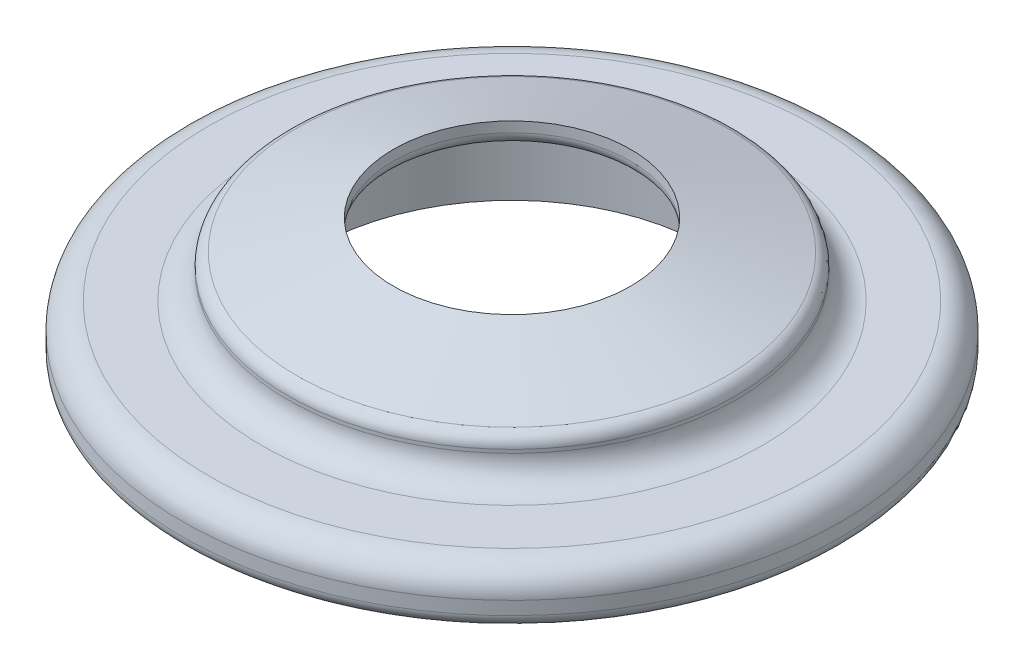
ISO-10303-21;
HEADER;
FILE_DESCRIPTION(('STEP AP214'),'2;1');
FILE_NAME('part.step','',(''),(''),'','','');
FILE_SCHEMA(('AUTOMOTIVE_DESIGN { 1 0 10303 214 1 1 1 1 }'));
ENDSEC;
DATA;
#1=APPLICATION_CONTEXT('core data for automotive mechanical design processes');
#2=APPLICATION_PROTOCOL_DEFINITION('international standard','automotive_design',2000,#1);
#3=PRODUCT_CONTEXT('',#1,'mechanical');
#4=PRODUCT('Part','Part','',(#3));
#5=PRODUCT_RELATED_PRODUCT_CATEGORY('part','',(#4));
#6=PRODUCT_DEFINITION_FORMATION('','',#4);
#7=PRODUCT_DEFINITION_CONTEXT('part definition',#1,'design');
#8=PRODUCT_DEFINITION('design','',#6,#7);
#9=PRODUCT_DEFINITION_SHAPE('','',#8);
#10=(LENGTH_UNIT() NAMED_UNIT(*) SI_UNIT(.MILLI.,.METRE.));
#11=(NAMED_UNIT(*) PLANE_ANGLE_UNIT() SI_UNIT($,.RADIAN.));
#12=(NAMED_UNIT(*) SI_UNIT($,.STERADIAN.) SOLID_ANGLE_UNIT());
#13=UNCERTAINTY_MEASURE_WITH_UNIT(LENGTH_MEASURE(1.E-05),#10,'distance_accuracy_value','');
#14=(GEOMETRIC_REPRESENTATION_CONTEXT(3) GLOBAL_UNCERTAINTY_ASSIGNED_CONTEXT((#13)) GLOBAL_UNIT_ASSIGNED_CONTEXT((#10,
#11,#12)) REPRESENTATION_CONTEXT('',''));
#15=CARTESIAN_POINT('',(0.,0.,0.));
#16=DIRECTION('',(0.,0.,1.));
#17=DIRECTION('',(1.,0.,0.));
#18=AXIS2_PLACEMENT_3D('',#15,#16,#17);
#19=CARTESIAN_POINT('',(0.,10.9557790087219,0.));
#20=DIRECTION('',(0.,-1.,0.));
#21=DIRECTION('',(1.,0.,0.));
#22=AXIS2_PLACEMENT_3D('',#19,#20,#21);
#23=CONICAL_SURFACE('',#22,4.14371822165366,1.27229739520872);
#24=CARTESIAN_POINT('',(0.,9.46153846153846,0.));
#25=DIRECTION('',(0.,-1.,0.));
#26=DIRECTION('',(1.,0.,0.));
#27=AXIS2_PLACEMENT_3D('',#24,#25,#26);
#28=CIRCLE('',#27,9.);
#29=CARTESIAN_POINT('',(9.,9.46153846153846,0.));
#30=VERTEX_POINT('',#29);
#31=EDGE_CURVE('E34',#30,#30,#28,.T.);
#32=ORIENTED_EDGE('',*,*,#31,.T.);
#33=EDGE_LOOP('',(#32));
#34=FACE_BOUND('',#33,.T.);
#35=CARTESIAN_POINT('',(0.,7.21720435420384,0.));
#36=DIRECTION('',(0.,-1.,0.));
#37=DIRECTION('',(1.,0.,0.));
#38=AXIS2_PLACEMENT_3D('',#35,#36,#37);
#39=CIRCLE('',#38,16.2940858488375);
#40=CARTESIAN_POINT('',(16.2940858488375,7.21720435420384,0.));
#41=VERTEX_POINT('',#40);
#42=EDGE_CURVE('E10',#41,#41,#39,.T.);
#43=ORIENTED_EDGE('',*,*,#42,.F.);
#44=EDGE_LOOP('',(#43));
#45=FACE_BOUND('',#44,.T.);
#46=ADVANCED_FACE('F31',(#34,#45),#23,.T.);
#47=CARTESIAN_POINT('',(0.,6.26142534548189,0.));
#48=DIRECTION('',(0.,-1.,0.));
#49=DIRECTION('',(1.,0.,0.));
#50=AXIS2_PLACEMENT_3D('',#47,#48,#49);
#51=TOROIDAL_SURFACE('',#50,16.,1.);
#52=CARTESIAN_POINT('',(0.,6.26142534548188,0.));
#53=DIRECTION('',(0.,-1.,0.));
#54=DIRECTION('',(1.,0.,0.));
#55=AXIS2_PLACEMENT_3D('',#52,#53,#54);
#56=CIRCLE('',#55,17.);
#57=CARTESIAN_POINT('',(17.,6.26142534548188,0.));
#58=VERTEX_POINT('',#57);
#59=EDGE_CURVE('E38',#58,#58,#56,.T.);
#60=ORIENTED_EDGE('',*,*,#59,.F.);
#61=EDGE_LOOP('',(#60));
#62=FACE_BOUND('',#61,.T.);
#63=ORIENTED_EDGE('',*,*,#42,.T.);
#64=EDGE_LOOP('',(#63));
#65=FACE_BOUND('',#64,.T.);
#66=ADVANCED_FACE('F103',(#62,#65),#51,.T.);
#67=CARTESIAN_POINT('',(0.,0.,0.));
#68=DIRECTION('',(0.,-1.,0.));
#69=DIRECTION('',(1.,0.,0.));
#70=AXIS2_PLACEMENT_3D('',#67,#68,#69);
#71=CYLINDRICAL_SURFACE('',#70,17.);
#72=CARTESIAN_POINT('',(0.,6.,0.));
#73=DIRECTION('',(0.,-1.,0.));
#74=DIRECTION('',(1.,0.,0.));
#75=AXIS2_PLACEMENT_3D('',#72,#73,#74);
#76=CIRCLE('',#75,17.);
#77=CARTESIAN_POINT('',(17.,6.,0.));
#78=VERTEX_POINT('',#77);
#79=EDGE_CURVE('E42',#78,#78,#76,.T.);
#80=ORIENTED_EDGE('',*,*,#79,.F.);
#81=EDGE_LOOP('',(#80));
#82=FACE_BOUND('',#81,.T.);
#83=ORIENTED_EDGE('',*,*,#59,.T.);
#84=EDGE_LOOP('',(#83));
#85=FACE_BOUND('',#84,.T.);
#86=ADVANCED_FACE('F107',(#82,#85),#71,.T.);
#87=CARTESIAN_POINT('',(0.,6.,0.));
#88=DIRECTION('',(0.,-1.,0.));
#89=DIRECTION('',(1.,0.,0.));
#90=AXIS2_PLACEMENT_3D('',#87,#88,#89);
#91=TOROIDAL_SURFACE('',#90,19.,2.);
#92=CARTESIAN_POINT('',(0.,4.,0.));
#93=DIRECTION('',(0.,-1.,0.));
#94=DIRECTION('',(1.,0.,0.));
#95=AXIS2_PLACEMENT_3D('',#92,#93,#94);
#96=CIRCLE('',#95,19.);
#97=CARTESIAN_POINT('',(19.,4.,0.));
#98=VERTEX_POINT('',#97);
#99=EDGE_CURVE('E47',#98,#98,#96,.T.);
#100=ORIENTED_EDGE('',*,*,#99,.F.);
#101=EDGE_LOOP('',(#100));
#102=FACE_BOUND('',#101,.T.);
#103=ORIENTED_EDGE('',*,*,#79,.T.);
#104=EDGE_LOOP('',(#103));
#105=FACE_BOUND('',#104,.T.);
#106=ADVANCED_FACE('F112',(#102,#105),#91,.F.);
#107=CARTESIAN_POINT('',(-23.,4.,0.));
#108=DIRECTION('',(0.,-1.,0.));
#109=DIRECTION('',(1.,0.,0.));
#110=AXIS2_PLACEMENT_3D('',#107,#108,#109);
#111=PLANE('',#110);
#112=CARTESIAN_POINT('',(0.,4.,0.));
#113=DIRECTION('',(0.,-1.,0.));
#114=DIRECTION('',(1.,0.,0.));
#115=AXIS2_PLACEMENT_3D('',#112,#113,#114);
#116=CIRCLE('',#115,23.);
#117=CARTESIAN_POINT('',(23.,4.,0.));
#118=VERTEX_POINT('',#117);
#119=EDGE_CURVE('E50',#118,#118,#116,.T.);
#120=ORIENTED_EDGE('',*,*,#119,.F.);
#121=EDGE_LOOP('',(#120));
#122=FACE_BOUND('',#121,.T.);
#123=ORIENTED_EDGE('',*,*,#99,.T.);
#124=EDGE_LOOP('',(#123));
#125=FACE_BOUND('',#124,.T.);
#126=ADVANCED_FACE('F119',(#122,#125),#111,.F.);
#127=CARTESIAN_POINT('',(0.,2.,0.));
#128=DIRECTION('',(0.,-1.,0.));
#129=DIRECTION('',(1.,0.,0.));
#130=AXIS2_PLACEMENT_3D('',#127,#128,#129);
#131=TOROIDAL_SURFACE('',#130,23.,2.);
#132=CARTESIAN_POINT('',(0.,1.99999999999999,0.));
#133=DIRECTION('',(0.,-1.,0.));
#134=DIRECTION('',(1.,0.,0.));
#135=AXIS2_PLACEMENT_3D('',#132,#133,#134);
#136=CIRCLE('',#135,25.);
#137=CARTESIAN_POINT('',(25.,1.99999999999999,0.));
#138=VERTEX_POINT('',#137);
#139=EDGE_CURVE('E53',#138,#138,#136,.T.);
#140=ORIENTED_EDGE('',*,*,#139,.F.);
#141=EDGE_LOOP('',(#140));
#142=FACE_BOUND('',#141,.T.);
#143=ORIENTED_EDGE('',*,*,#119,.T.);
#144=EDGE_LOOP('',(#143));
#145=FACE_BOUND('',#144,.T.);
#146=ADVANCED_FACE('F123',(#142,#145),#131,.T.);
#147=CARTESIAN_POINT('',(0.,0.,0.));
#148=DIRECTION('',(0.,-1.,0.));
#149=DIRECTION('',(1.,0.,0.));
#150=AXIS2_PLACEMENT_3D('',#147,#148,#149);
#151=CYLINDRICAL_SURFACE('',#150,25.);
#152=CARTESIAN_POINT('',(0.,1.,0.));
#153=DIRECTION('',(0.,-1.,0.));
#154=DIRECTION('',(1.,0.,0.));
#155=AXIS2_PLACEMENT_3D('',#152,#153,#154);
#156=CIRCLE('',#155,25.);
#157=CARTESIAN_POINT('',(25.,1.,0.));
#158=VERTEX_POINT('',#157);
#159=EDGE_CURVE('E56',#158,#158,#156,.T.);
#160=ORIENTED_EDGE('',*,*,#159,.F.);
#161=EDGE_LOOP('',(#160));
#162=FACE_BOUND('',#161,.T.);
#163=ORIENTED_EDGE('',*,*,#139,.T.);
#164=EDGE_LOOP('',(#163));
#165=FACE_BOUND('',#164,.T.);
#166=ADVANCED_FACE('F127',(#162,#165),#151,.T.);
#167=CARTESIAN_POINT('',(0.,1.,0.));
#168=DIRECTION('',(0.,-1.,0.));
#169=DIRECTION('',(1.,0.,0.));
#170=AXIS2_PLACEMENT_3D('',#167,#168,#169);
#171=TOROIDAL_SURFACE('',#170,24.,1.);
#172=CARTESIAN_POINT('',(0.,0.,0.));
#173=DIRECTION('',(0.,-1.,0.));
#174=DIRECTION('',(1.,0.,0.));
#175=AXIS2_PLACEMENT_3D('',#172,#173,#174);
#176=CIRCLE('',#175,24.);
#177=CARTESIAN_POINT('',(24.,0.,0.));
#178=VERTEX_POINT('',#177);
#179=EDGE_CURVE('E59',#178,#178,#176,.T.);
#180=ORIENTED_EDGE('',*,*,#179,.F.);
#181=EDGE_LOOP('',(#180));
#182=FACE_BOUND('',#181,.T.);
#183=ORIENTED_EDGE('',*,*,#159,.T.);
#184=EDGE_LOOP('',(#183));
#185=FACE_BOUND('',#184,.T.);
#186=ADVANCED_FACE('F131',(#182,#185),#171,.T.);
#187=CARTESIAN_POINT('',(0.,0.,0.));
#188=DIRECTION('',(0.,1.,0.));
#189=DIRECTION('',(-1.,0.,0.));
#190=AXIS2_PLACEMENT_3D('',#187,#188,#189);
#191=PLANE('',#190);
#192=CARTESIAN_POINT('',(0.,0.,0.));
#193=DIRECTION('',(0.,1.,0.));
#194=DIRECTION('',(-1.,0.,0.));
#195=AXIS2_PLACEMENT_3D('',#192,#193,#194);
#196=CIRCLE('',#195,15.);
#197=CARTESIAN_POINT('',(-15.,0.,0.));
#198=VERTEX_POINT('',#197);
#199=EDGE_CURVE('E65',#198,#198,#196,.T.);
#200=ORIENTED_EDGE('',*,*,#199,.T.);
#201=EDGE_LOOP('',(#200));
#202=FACE_BOUND('',#201,.T.);
#203=ORIENTED_EDGE('',*,*,#179,.T.);
#204=EDGE_LOOP('',(#203));
#205=FACE_BOUND('',#204,.T.);
#206=ADVANCED_FACE('F96',(#202,#205),#191,.F.);
#207=CARTESIAN_POINT('',(0.,11.,0.));
#208=DIRECTION('',(0.,1.,0.));
#209=DIRECTION('',(-1.,0.,0.));
#210=AXIS2_PLACEMENT_3D('',#207,#208,#209);
#211=CYLINDRICAL_SURFACE('',#210,9.);
#212=CARTESIAN_POINT('',(0.,8.6830661312128,0.));
#213=DIRECTION('',(0.,1.,0.));
#214=DIRECTION('',(-1.,0.,0.));
#215=AXIS2_PLACEMENT_3D('',#212,#213,#214);
#216=CIRCLE('',#215,9.);
#217=CARTESIAN_POINT('',(-9.,8.6830661312128,0.));
#218=VERTEX_POINT('',#217);
#219=EDGE_CURVE('E68',#218,#218,#216,.T.);
#220=ORIENTED_EDGE('',*,*,#219,.F.);
#221=EDGE_LOOP('',(#220));
#222=FACE_BOUND('',#221,.T.);
#223=ORIENTED_EDGE('',*,*,#31,.F.);
#224=EDGE_LOOP('',(#223));
#225=FACE_BOUND('',#224,.T.);
#226=ADVANCED_FACE('F93',(#222,#225),#211,.F.);
#227=CARTESIAN_POINT('',(0.,6.30527356808344,0.));
#228=DIRECTION('',(0.,1.,0.));
#229=DIRECTION('',(-1.,0.,0.));
#230=AXIS2_PLACEMENT_3D('',#227,#228,#229);
#231=TOROIDAL_SURFACE('',#230,14.,1.);
#232=CARTESIAN_POINT('',(0.,6.30527356808344,0.));
#233=DIRECTION('',(0.,1.,0.));
#234=DIRECTION('',(-1.,0.,0.));
#235=AXIS2_PLACEMENT_3D('',#232,#233,#234);
#236=CIRCLE('',#235,15.);
#237=CARTESIAN_POINT('',(-15.,6.30527356808343,0.));
#238=VERTEX_POINT('',#237);
#239=EDGE_CURVE('E62',#238,#238,#236,.T.);
#240=ORIENTED_EDGE('',*,*,#239,.F.);
#241=EDGE_LOOP('',(#240));
#242=FACE_BOUND('',#241,.T.);
#243=CARTESIAN_POINT('',(0.,7.30103895832568,0.));
#244=DIRECTION('',(0.,1.,0.));
#245=DIRECTION('',(-1.,0.,0.));
#246=AXIS2_PLACEMENT_3D('',#243,#244,#245);
#247=CIRCLE('',#246,14.0919308848849);
#248=CARTESIAN_POINT('',(-14.0919308848849,7.30103895832567,0.));
#249=VERTEX_POINT('',#248);
#250=EDGE_CURVE('E74',#249,#249,#247,.T.);
#251=ORIENTED_EDGE('',*,*,#250,.T.);
#252=EDGE_LOOP('',(#251));
#253=FACE_BOUND('',#252,.T.);
#254=ADVANCED_FACE('F78',(#242,#253),#231,.F.);
#255=CARTESIAN_POINT('',(0.,11.,0.));
#256=DIRECTION('',(0.,1.,0.));
#257=DIRECTION('',(-1.,0.,0.));
#258=AXIS2_PLACEMENT_3D('',#255,#256,#257);
#259=CYLINDRICAL_SURFACE('',#258,15.);
#260=ORIENTED_EDGE('',*,*,#199,.F.);
#261=EDGE_LOOP('',(#260));
#262=FACE_BOUND('',#261,.T.);
#263=ORIENTED_EDGE('',*,*,#239,.T.);
#264=EDGE_LOOP('',(#263));
#265=FACE_BOUND('',#264,.T.);
#266=ADVANCED_FACE('F89',(#262,#265),#259,.F.);
#267=CARTESIAN_POINT('',(0.,8.6830661312128,0.));
#268=DIRECTION('',(0.,1.,0.));
#269=DIRECTION('',(-1.,0.,0.));
#270=AXIS2_PLACEMENT_3D('',#267,#268,#269);
#271=TOROIDAL_SURFACE('',#270,10.,0.999999999999999);
#272=CARTESIAN_POINT('',(0.,7.68730074097057,0.));
#273=DIRECTION('',(0.,1.,0.));
#274=DIRECTION('',(-1.,0.,0.));
#275=AXIS2_PLACEMENT_3D('',#272,#273,#274);
#276=CIRCLE('',#275,9.9080691151151);
#277=CARTESIAN_POINT('',(-9.9080691151151,7.68730074097056,0.));
#278=VERTEX_POINT('',#277);
#279=EDGE_CURVE('E71',#278,#278,#276,.T.);
#280=ORIENTED_EDGE('',*,*,#279,.F.);
#281=EDGE_LOOP('',(#280));
#282=FACE_BOUND('',#281,.T.);
#283=ORIENTED_EDGE('',*,*,#219,.T.);
#284=EDGE_LOOP('',(#283));
#285=FACE_BOUND('',#284,.T.);
#286=ADVANCED_FACE('F83',(#282,#285),#271,.T.);
#287=CARTESIAN_POINT('',(0.,7.68730074097057,0.));
#288=DIRECTION('',(0.,-1.,0.));
#289=DIRECTION('',(1.,0.,0.));
#290=AXIS2_PLACEMENT_3D('',#287,#288,#289);
#291=CONICAL_SURFACE('',#290,9.9080691151151,1.47873545790332);
#292=ORIENTED_EDGE('',*,*,#250,.F.);
#293=EDGE_LOOP('',(#292));
#294=FACE_BOUND('',#293,.T.);
#295=ORIENTED_EDGE('',*,*,#279,.T.);
#296=EDGE_LOOP('',(#295));
#297=FACE_BOUND('',#296,.T.);
#298=ADVANCED_FACE('F80',(#294,#297),#291,.F.);
#299=CLOSED_SHELL('',(#46,#66,#86,#106,#126,#146,#166,#186,#206,#226,#254,#266,#286,#298));
#300=MANIFOLD_SOLID_BREP('B2',#299);
#301=ADVANCED_BREP_SHAPE_REPRESENTATION('',(#18,#300),#14);
#302=SHAPE_DEFINITION_REPRESENTATION(#9,#301);
ENDSEC;
END-ISO-10303-21;
